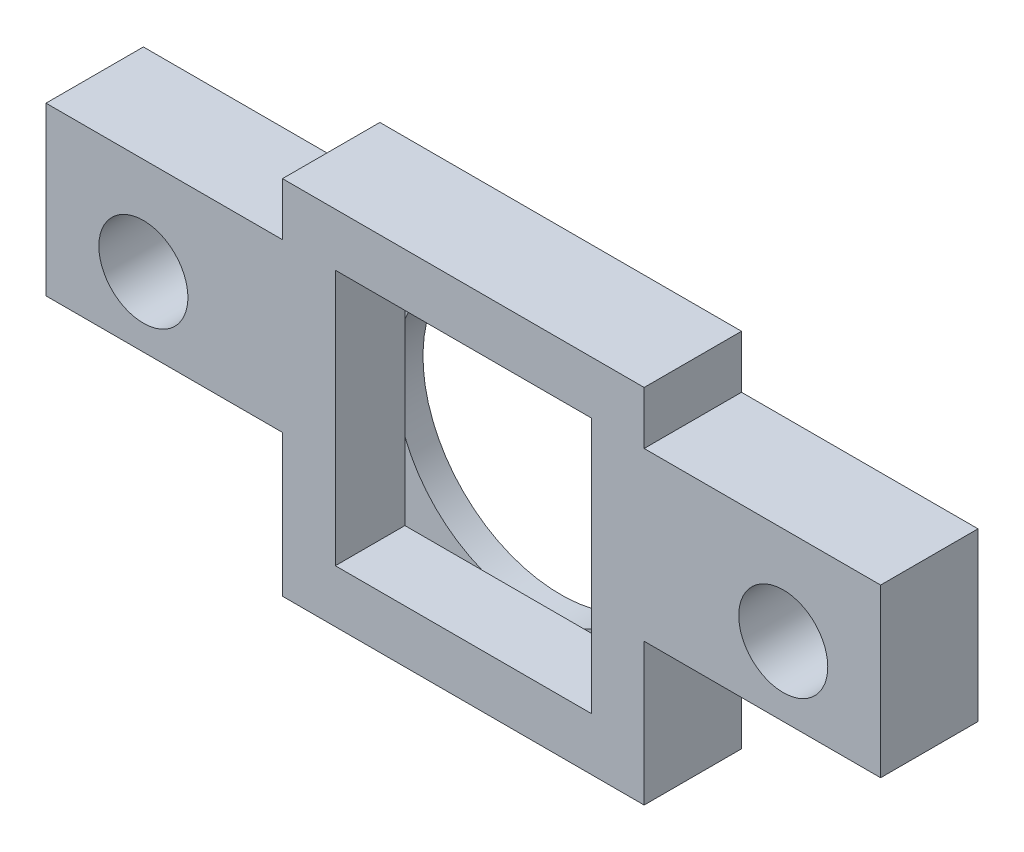
ISO-10303-21;
HEADER;
FILE_DESCRIPTION(('STEP AP214'),'2;1');
FILE_NAME('part.step','',(''),(''),'','','');
FILE_SCHEMA(('AUTOMOTIVE_DESIGN { 1 0 10303 214 1 1 1 1 }'));
ENDSEC;
DATA;
#1=APPLICATION_CONTEXT('core data for automotive mechanical design processes');
#2=APPLICATION_PROTOCOL_DEFINITION('international standard','automotive_design',2000,#1);
#3=PRODUCT_CONTEXT('',#1,'mechanical');
#4=PRODUCT('Part','Part','',(#3));
#5=PRODUCT_RELATED_PRODUCT_CATEGORY('part','',(#4));
#6=PRODUCT_DEFINITION_FORMATION('','',#4);
#7=PRODUCT_DEFINITION_CONTEXT('part definition',#1,'design');
#8=PRODUCT_DEFINITION('design','',#6,#7);
#9=PRODUCT_DEFINITION_SHAPE('','',#8);
#10=(LENGTH_UNIT() NAMED_UNIT(*) SI_UNIT(.MILLI.,.METRE.));
#11=(NAMED_UNIT(*) PLANE_ANGLE_UNIT() SI_UNIT($,.RADIAN.));
#12=(NAMED_UNIT(*) SI_UNIT($,.STERADIAN.) SOLID_ANGLE_UNIT());
#13=UNCERTAINTY_MEASURE_WITH_UNIT(LENGTH_MEASURE(1.E-05),#10,'distance_accuracy_value','');
#14=(GEOMETRIC_REPRESENTATION_CONTEXT(3) GLOBAL_UNCERTAINTY_ASSIGNED_CONTEXT((#13)) GLOBAL_UNIT_ASSIGNED_CONTEXT((#10,
#11,#12)) REPRESENTATION_CONTEXT('',''));
#15=CARTESIAN_POINT('',(0.,0.,0.));
#16=DIRECTION('',(0.,0.,1.));
#17=DIRECTION('',(1.,0.,0.));
#18=AXIS2_PLACEMENT_3D('',#15,#16,#17);
#19=CARTESIAN_POINT('',(-7.06578398919392,7.59595689298066,1.));
#20=DIRECTION('',(1.,0.,0.));
#21=DIRECTION('',(0.,1.,0.));
#22=AXIS2_PLACEMENT_3D('',#19,#20,#21);
#23=PLANE('',#22);
#24=DIRECTION('',(0.,0.,1.));
#25=VECTOR('',#24,1.);
#26=CARTESIAN_POINT('',(-7.06578398919392,-0.304043107019338,0.));
#27=LINE('',#26,#25);
#28=CARTESIAN_POINT('',(-7.06578398919392,-0.304043107019338,0.));
#29=VERTEX_POINT('',#28);
#30=CARTESIAN_POINT('',(-7.06578398919392,-0.304043107019338,3.5));
#31=VERTEX_POINT('',#30);
#32=EDGE_CURVE('E212',#29,#31,#27,.T.);
#33=ORIENTED_EDGE('',*,*,#32,.F.);
#34=DIRECTION('',(0.,-1.,0.));
#35=VECTOR('',#34,1.);
#36=CARTESIAN_POINT('',(-7.06578398919392,7.59595689298066,0.));
#37=LINE('',#36,#35);
#38=CARTESIAN_POINT('',(-7.06578398919391,-5.40404310701934,0.));
#39=VERTEX_POINT('',#38);
#40=EDGE_CURVE('E294',#29,#39,#37,.T.);
#41=ORIENTED_EDGE('',*,*,#40,.T.);
#42=DIRECTION('',(0.,0.,-1.));
#43=VECTOR('',#42,1.);
#44=CARTESIAN_POINT('',(-7.06578398919391,-5.40404310701934,1.));
#45=LINE('',#44,#43);
#46=CARTESIAN_POINT('',(-7.06578398919392,-5.40404310701934,3.5));
#47=VERTEX_POINT('',#46);
#48=EDGE_CURVE('E39',#47,#39,#45,.T.);
#49=ORIENTED_EDGE('',*,*,#48,.F.);
#50=DIRECTION('',(0.,-1.,0.));
#51=VECTOR('',#50,1.);
#52=CARTESIAN_POINT('',(-7.06578398919392,7.59595689298066,3.5));
#53=LINE('',#52,#51);
#54=EDGE_CURVE('E276',#31,#47,#53,.T.);
#55=ORIENTED_EDGE('',*,*,#54,.F.);
#56=EDGE_LOOP('',(#33,#41,#49,#55));
#57=FACE_BOUND('',#56,.T.);
#58=ADVANCED_FACE('F35',(#57),#23,.F.);
#59=CARTESIAN_POINT('',(5.93421601080608,7.59595689298066,1.));
#60=DIRECTION('',(-1.,0.,0.));
#61=DIRECTION('',(0.,-1.,0.));
#62=AXIS2_PLACEMENT_3D('',#59,#60,#61);
#63=PLANE('',#62);
#64=DIRECTION('',(0.,0.,1.));
#65=VECTOR('',#64,1.);
#66=CARTESIAN_POINT('',(5.93421601080608,5.69595689298066,0.));
#67=LINE('',#66,#65);
#68=CARTESIAN_POINT('',(5.93421601080608,5.69595689298066,0.));
#69=VERTEX_POINT('',#68);
#70=CARTESIAN_POINT('',(5.93421601080608,5.69595689298066,3.5));
#71=VERTEX_POINT('',#70);
#72=EDGE_CURVE('E236',#69,#71,#67,.T.);
#73=ORIENTED_EDGE('',*,*,#72,.F.);
#74=DIRECTION('',(0.,1.,0.));
#75=VECTOR('',#74,1.);
#76=CARTESIAN_POINT('',(5.93421601080608,7.59595689298066,0.));
#77=LINE('',#76,#75);
#78=CARTESIAN_POINT('',(5.93421601080608,7.59595689298066,0.));
#79=VERTEX_POINT('',#78);
#80=EDGE_CURVE('E303',#69,#79,#77,.T.);
#81=ORIENTED_EDGE('',*,*,#80,.T.);
#82=DIRECTION('',(0.,0.,-1.));
#83=VECTOR('',#82,1.);
#84=CARTESIAN_POINT('',(5.93421601080608,7.59595689298066,1.));
#85=LINE('',#84,#83);
#86=CARTESIAN_POINT('',(5.93421601080608,7.59595689298066,3.5));
#87=VERTEX_POINT('',#86);
#88=EDGE_CURVE('E312',#87,#79,#85,.T.);
#89=ORIENTED_EDGE('',*,*,#88,.F.);
#90=DIRECTION('',(0.,1.,0.));
#91=VECTOR('',#90,1.);
#92=CARTESIAN_POINT('',(5.93421601080608,7.59595689298066,3.5));
#93=LINE('',#92,#91);
#94=EDGE_CURVE('E283',#71,#87,#93,.T.);
#95=ORIENTED_EDGE('',*,*,#94,.F.);
#96=EDGE_LOOP('',(#73,#81,#89,#95));
#97=FACE_BOUND('',#96,.T.);
#98=ADVANCED_FACE('F400',(#97),#63,.F.);
#99=CARTESIAN_POINT('',(0.,0.,1.));
#100=DIRECTION('',(0.,0.,1.));
#101=DIRECTION('',(1.,0.,0.));
#102=AXIS2_PLACEMENT_3D('',#99,#100,#101);
#103=PLANE('',#102);
#104=CARTESIAN_POINT('',(-0.565783989193916,1.09595689298066,1.));
#105=DIRECTION('',(0.,0.,1.));
#106=DIRECTION('',(1.,0.,0.));
#107=AXIS2_PLACEMENT_3D('',#104,#105,#106);
#108=CIRCLE('',#107,4.95);
#109=CARTESIAN_POINT('',(-5.16578398919392,-0.732293636897562,1.));
#110=VERTEX_POINT('',#109);
#111=CARTESIAN_POINT('',(-2.39403451907214,-3.50404310701934,1.));
#112=VERTEX_POINT('',#111);
#113=EDGE_CURVE('E372',#110,#112,#108,.T.);
#114=ORIENTED_EDGE('',*,*,#113,.F.);
#115=DIRECTION('',(0.,-1.,0.));
#116=VECTOR('',#115,1.);
#117=CARTESIAN_POINT('',(-5.16578398919392,5.69595689298066,1.));
#118=LINE('',#117,#116);
#119=CARTESIAN_POINT('',(-5.16578398919391,-3.50404310701934,1.));
#120=VERTEX_POINT('',#119);
#121=EDGE_CURVE('E11',#110,#120,#118,.T.);
#122=ORIENTED_EDGE('',*,*,#121,.T.);
#123=DIRECTION('',(1.,0.,0.));
#124=VECTOR('',#123,1.);
#125=CARTESIAN_POINT('',(-5.16578398919391,-3.50404310701934,1.));
#126=LINE('',#125,#124);
#127=EDGE_CURVE('E256',#120,#112,#126,.T.);
#128=ORIENTED_EDGE('',*,*,#127,.T.);
#129=EDGE_LOOP('',(#114,#122,#128));
#130=FACE_BOUND('',#129,.T.);
#131=ADVANCED_FACE('F371',(#130),#103,.T.);
#132=CARTESIAN_POINT('',(1.26246654068431,-3.50404310701934,1.));
#133=VERTEX_POINT('',#132);
#134=CARTESIAN_POINT('',(4.03421601080608,-0.732293636897559,1.));
#135=VERTEX_POINT('',#134);
#136=EDGE_CURVE('E375',#133,#135,#108,.T.);
#137=ORIENTED_EDGE('',*,*,#136,.F.);
#138=CARTESIAN_POINT('',(4.03421601080609,-3.50404310701934,1.));
#139=VERTEX_POINT('',#138);
#140=EDGE_CURVE('E44',#133,#139,#126,.T.);
#141=ORIENTED_EDGE('',*,*,#140,.T.);
#142=DIRECTION('',(0.,1.,0.));
#143=VECTOR('',#142,1.);
#144=CARTESIAN_POINT('',(4.03421601080608,5.69595689298066,1.));
#145=LINE('',#144,#143);
#146=EDGE_CURVE('E260',#139,#135,#145,.T.);
#147=ORIENTED_EDGE('',*,*,#146,.T.);
#148=EDGE_LOOP('',(#137,#141,#147));
#149=FACE_BOUND('',#148,.T.);
#150=ADVANCED_FACE('F379',(#149),#103,.T.);
#151=CARTESIAN_POINT('',(4.03421601080608,2.92420742285889,1.));
#152=VERTEX_POINT('',#151);
#153=CARTESIAN_POINT('',(1.26246654068431,5.69595689298066,1.));
#154=VERTEX_POINT('',#153);
#155=EDGE_CURVE('E291',#152,#154,#108,.T.);
#156=ORIENTED_EDGE('',*,*,#155,.F.);
#157=CARTESIAN_POINT('',(4.03421601080608,5.69595689298066,1.));
#158=VERTEX_POINT('',#157);
#159=EDGE_CURVE('E264',#152,#158,#145,.T.);
#160=ORIENTED_EDGE('',*,*,#159,.T.);
#161=DIRECTION('',(-1.,0.,0.));
#162=VECTOR('',#161,1.);
#163=CARTESIAN_POINT('',(-5.16578398919392,5.69595689298066,1.));
#164=LINE('',#163,#162);
#165=EDGE_CURVE('E246',#158,#154,#164,.T.);
#166=ORIENTED_EDGE('',*,*,#165,.T.);
#167=EDGE_LOOP('',(#156,#160,#166));
#168=FACE_BOUND('',#167,.T.);
#169=ADVANCED_FACE('F347',(#168),#103,.T.);
#170=CARTESIAN_POINT('',(-2.39403451907214,5.69595689298066,1.));
#171=VERTEX_POINT('',#170);
#172=CARTESIAN_POINT('',(-5.16578398919392,5.69595689298066,1.));
#173=VERTEX_POINT('',#172);
#174=EDGE_CURVE('E267',#171,#173,#164,.T.);
#175=ORIENTED_EDGE('',*,*,#174,.T.);
#176=CARTESIAN_POINT('',(-5.16578398919392,2.92420742285888,1.));
#177=VERTEX_POINT('',#176);
#178=EDGE_CURVE('E46',#173,#177,#118,.T.);
#179=ORIENTED_EDGE('',*,*,#178,.T.);
#180=EDGE_CURVE('E335',#171,#177,#108,.T.);
#181=ORIENTED_EDGE('',*,*,#180,.F.);
#182=EDGE_LOOP('',(#175,#179,#181));
#183=FACE_BOUND('',#182,.T.);
#184=ADVANCED_FACE('F336',(#183),#103,.T.);
#185=CARTESIAN_POINT('',(0.,0.,0.));
#186=DIRECTION('',(0.,0.,1.));
#187=DIRECTION('',(1.,0.,0.));
#188=AXIS2_PLACEMENT_3D('',#185,#186,#187);
#189=PLANE('',#188);
#190=CARTESIAN_POINT('',(-7.06578398919392,7.59595689298066,0.));
#191=VERTEX_POINT('',#190);
#192=CARTESIAN_POINT('',(-7.06578398919392,5.69595689298066,0.));
#193=VERTEX_POINT('',#192);
#194=EDGE_CURVE('E299',#191,#193,#37,.T.);
#195=ORIENTED_EDGE('',*,*,#194,.F.);
#196=DIRECTION('',(-1.,0.,0.));
#197=VECTOR('',#196,1.);
#198=CARTESIAN_POINT('',(-7.06578398919392,7.59595689298066,0.));
#199=LINE('',#198,#197);
#200=EDGE_CURVE('E307',#79,#191,#199,.T.);
#201=ORIENTED_EDGE('',*,*,#200,.F.);
#202=ORIENTED_EDGE('',*,*,#80,.F.);
#203=DIRECTION('',(-1.,0.,0.));
#204=VECTOR('',#203,1.);
#205=CARTESIAN_POINT('',(5.93421601080608,5.69595689298066,0.));
#206=LINE('',#205,#204);
#207=CARTESIAN_POINT('',(14.4342160108061,5.69595689298066,0.));
#208=VERTEX_POINT('',#207);
#209=EDGE_CURVE('E227',#208,#69,#206,.T.);
#210=ORIENTED_EDGE('',*,*,#209,.F.);
#211=DIRECTION('',(0.,1.,0.));
#212=VECTOR('',#211,1.);
#213=CARTESIAN_POINT('',(14.4342160108061,5.69595689298066,0.));
#214=LINE('',#213,#212);
#215=CARTESIAN_POINT('',(14.4342160108061,-0.304043107019336,0.));
#216=VERTEX_POINT('',#215);
#217=EDGE_CURVE('E223',#216,#208,#214,.T.);
#218=ORIENTED_EDGE('',*,*,#217,.F.);
#219=DIRECTION('',(1.,0.,0.));
#220=VECTOR('',#219,1.);
#221=CARTESIAN_POINT('',(5.93421601080609,-0.304043107019336,0.));
#222=LINE('',#221,#220);
#223=CARTESIAN_POINT('',(5.93421601080609,-0.304043107019336,0.));
#224=VERTEX_POINT('',#223);
#225=EDGE_CURVE('E220',#224,#216,#222,.T.);
#226=ORIENTED_EDGE('',*,*,#225,.F.);
#227=CARTESIAN_POINT('',(5.93421601080608,-5.40404310701934,0.));
#228=VERTEX_POINT('',#227);
#229=EDGE_CURVE('E304',#228,#224,#77,.T.);
#230=ORIENTED_EDGE('',*,*,#229,.F.);
#231=DIRECTION('',(1.,0.,0.));
#232=VECTOR('',#231,1.);
#233=CARTESIAN_POINT('',(-7.06578398919391,-5.40404310701934,0.));
#234=LINE('',#233,#232);
#235=EDGE_CURVE('E301',#39,#228,#234,.T.);
#236=ORIENTED_EDGE('',*,*,#235,.F.);
#237=ORIENTED_EDGE('',*,*,#40,.F.);
#238=DIRECTION('',(1.,0.,0.));
#239=VECTOR('',#238,1.);
#240=CARTESIAN_POINT('',(-7.06578398919392,-0.304043107019338,0.));
#241=LINE('',#240,#239);
#242=CARTESIAN_POINT('',(-15.5657839891939,-0.30404310701934,0.));
#243=VERTEX_POINT('',#242);
#244=EDGE_CURVE('E184',#243,#29,#241,.T.);
#245=ORIENTED_EDGE('',*,*,#244,.F.);
#246=DIRECTION('',(0.,-1.,0.));
#247=VECTOR('',#246,1.);
#248=CARTESIAN_POINT('',(-15.5657839891939,5.69595689298066,0.));
#249=LINE('',#248,#247);
#250=CARTESIAN_POINT('',(-15.5657839891939,5.69595689298066,0.));
#251=VERTEX_POINT('',#250);
#252=EDGE_CURVE('E179',#251,#243,#249,.T.);
#253=ORIENTED_EDGE('',*,*,#252,.F.);
#254=DIRECTION('',(-1.,0.,0.));
#255=VECTOR('',#254,1.);
#256=CARTESIAN_POINT('',(-7.06578398919392,5.69595689298066,0.));
#257=LINE('',#256,#255);
#258=EDGE_CURVE('E192',#193,#251,#257,.T.);
#259=ORIENTED_EDGE('',*,*,#258,.F.);
#260=EDGE_LOOP('',(#195,#201,#202,#210,#218,#226,#230,#236,#237,#245,#253,#259));
#261=FACE_BOUND('',#260,.T.);
#262=CARTESIAN_POINT('',(-0.565783989193916,1.09595689298066,0.));
#263=DIRECTION('',(0.,0.,1.));
#264=DIRECTION('',(1.,0.,0.));
#265=AXIS2_PLACEMENT_3D('',#262,#263,#264);
#266=CIRCLE('',#265,4.95);
#267=CARTESIAN_POINT('',(4.38421601080608,1.09595689298066,0.));
#268=VERTEX_POINT('',#267);
#269=EDGE_CURVE('E290',#268,#268,#266,.T.);
#270=ORIENTED_EDGE('',*,*,#269,.T.);
#271=EDGE_LOOP('',(#270));
#272=FACE_BOUND('',#271,.T.);
#273=CARTESIAN_POINT('',(10.9342160108061,2.19595689298066,0.));
#274=DIRECTION('',(0.,0.,1.));
#275=DIRECTION('',(1.,0.,0.));
#276=AXIS2_PLACEMENT_3D('',#273,#274,#275);
#277=CIRCLE('',#276,1.6);
#278=CARTESIAN_POINT('',(12.5342160108061,2.19595689298066,0.));
#279=VERTEX_POINT('',#278);
#280=EDGE_CURVE('E215',#279,#279,#277,.T.);
#281=ORIENTED_EDGE('',*,*,#280,.T.);
#282=EDGE_LOOP('',(#281));
#283=FACE_BOUND('',#282,.T.);
#284=CARTESIAN_POINT('',(-12.0657839891939,2.19595689298066,0.));
#285=DIRECTION('',(0.,0.,1.));
#286=DIRECTION('',(-1.,0.,0.));
#287=AXIS2_PLACEMENT_3D('',#284,#285,#286);
#288=CIRCLE('',#287,1.6);
#289=CARTESIAN_POINT('',(-13.6657839891939,2.19595689298066,0.));
#290=VERTEX_POINT('',#289);
#291=EDGE_CURVE('E208',#290,#290,#288,.T.);
#292=ORIENTED_EDGE('',*,*,#291,.T.);
#293=EDGE_LOOP('',(#292));
#294=FACE_BOUND('',#293,.T.);
#295=ADVANCED_FACE('F190',(#261,#272,#283,#294),#189,.F.);
#296=ORIENTED_EDGE('',*,*,#194,.T.);
#297=DIRECTION('',(0.,0.,1.));
#298=VECTOR('',#297,1.);
#299=CARTESIAN_POINT('',(-7.06578398919392,5.69595689298066,0.));
#300=LINE('',#299,#298);
#301=CARTESIAN_POINT('',(-7.06578398919392,5.69595689298066,3.5));
#302=VERTEX_POINT('',#301);
#303=EDGE_CURVE('E197',#193,#302,#300,.T.);
#304=ORIENTED_EDGE('',*,*,#303,.T.);
#305=CARTESIAN_POINT('',(-7.06578398919392,7.59595689298066,3.5));
#306=VERTEX_POINT('',#305);
#307=EDGE_CURVE('E277',#306,#302,#53,.T.);
#308=ORIENTED_EDGE('',*,*,#307,.F.);
#309=DIRECTION('',(0.,0.,-1.));
#310=VECTOR('',#309,1.);
#311=CARTESIAN_POINT('',(-7.06578398919392,7.59595689298066,1.));
#312=LINE('',#311,#310);
#313=EDGE_CURVE('E309',#306,#191,#312,.T.);
#314=ORIENTED_EDGE('',*,*,#313,.T.);
#315=EDGE_LOOP('',(#296,#304,#308,#314));
#316=FACE_BOUND('',#315,.T.);
#317=ADVANCED_FACE('F37',(#316),#23,.F.);
#318=CARTESIAN_POINT('',(-7.06578398919391,-5.40404310701934,1.));
#319=DIRECTION('',(0.,1.,0.));
#320=DIRECTION('',(0.,0.,1.));
#321=AXIS2_PLACEMENT_3D('',#318,#319,#320);
#322=PLANE('',#321);
#323=ORIENTED_EDGE('',*,*,#235,.T.);
#324=DIRECTION('',(0.,0.,-1.));
#325=VECTOR('',#324,1.);
#326=CARTESIAN_POINT('',(5.93421601080608,-5.40404310701934,1.));
#327=LINE('',#326,#325);
#328=CARTESIAN_POINT('',(5.93421601080608,-5.40404310701934,3.5));
#329=VERTEX_POINT('',#328);
#330=EDGE_CURVE('E314',#329,#228,#327,.T.);
#331=ORIENTED_EDGE('',*,*,#330,.F.);
#332=DIRECTION('',(1.,0.,0.));
#333=VECTOR('',#332,1.);
#334=CARTESIAN_POINT('',(-7.06578398919392,-5.40404310701934,3.5));
#335=LINE('',#334,#333);
#336=EDGE_CURVE('E280',#47,#329,#335,.T.);
#337=ORIENTED_EDGE('',*,*,#336,.F.);
#338=ORIENTED_EDGE('',*,*,#48,.T.);
#339=EDGE_LOOP('',(#323,#331,#337,#338));
#340=FACE_BOUND('',#339,.T.);
#341=ADVANCED_FACE('F410',(#340),#322,.F.);
#342=ORIENTED_EDGE('',*,*,#229,.T.);
#343=DIRECTION('',(0.,0.,1.));
#344=VECTOR('',#343,1.);
#345=CARTESIAN_POINT('',(5.93421601080609,-0.304043107019336,0.));
#346=LINE('',#345,#344);
#347=CARTESIAN_POINT('',(5.93421601080608,-0.304043107019333,3.5));
#348=VERTEX_POINT('',#347);
#349=EDGE_CURVE('E229',#224,#348,#346,.T.);
#350=ORIENTED_EDGE('',*,*,#349,.T.);
#351=EDGE_CURVE('E284',#329,#348,#93,.T.);
#352=ORIENTED_EDGE('',*,*,#351,.F.);
#353=ORIENTED_EDGE('',*,*,#330,.T.);
#354=EDGE_LOOP('',(#342,#350,#352,#353));
#355=FACE_BOUND('',#354,.T.);
#356=ADVANCED_FACE('F407',(#355),#63,.F.);
#357=CARTESIAN_POINT('',(-7.06578398919392,7.59595689298066,1.));
#358=DIRECTION('',(0.,-1.,0.));
#359=DIRECTION('',(0.,0.,-1.));
#360=AXIS2_PLACEMENT_3D('',#357,#358,#359);
#361=PLANE('',#360);
#362=ORIENTED_EDGE('',*,*,#200,.T.);
#363=ORIENTED_EDGE('',*,*,#313,.F.);
#364=DIRECTION('',(-1.,0.,0.));
#365=VECTOR('',#364,1.);
#366=CARTESIAN_POINT('',(-7.06578398919392,7.59595689298066,3.5));
#367=LINE('',#366,#365);
#368=EDGE_CURVE('E287',#87,#306,#367,.T.);
#369=ORIENTED_EDGE('',*,*,#368,.F.);
#370=ORIENTED_EDGE('',*,*,#88,.T.);
#371=EDGE_LOOP('',(#362,#363,#369,#370));
#372=FACE_BOUND('',#371,.T.);
#373=ADVANCED_FACE('F422',(#372),#361,.F.);
#374=CARTESIAN_POINT('',(-0.565783989193916,1.09595689298066,1.));
#375=DIRECTION('',(0.,0.,-1.));
#376=DIRECTION('',(-1.,0.,0.));
#377=AXIS2_PLACEMENT_3D('',#374,#375,#376);
#378=CYLINDRICAL_SURFACE('',#377,4.95);
#379=ORIENTED_EDGE('',*,*,#155,.T.);
#380=EDGE_CURVE('E295',#154,#171,#108,.T.);
#381=ORIENTED_EDGE('',*,*,#380,.T.);
#382=ORIENTED_EDGE('',*,*,#180,.T.);
#383=EDGE_CURVE('E340',#177,#110,#108,.T.);
#384=ORIENTED_EDGE('',*,*,#383,.T.);
#385=ORIENTED_EDGE('',*,*,#113,.T.);
#386=EDGE_CURVE('E374',#112,#133,#108,.T.);
#387=ORIENTED_EDGE('',*,*,#386,.T.);
#388=ORIENTED_EDGE('',*,*,#136,.T.);
#389=EDGE_CURVE('E296',#135,#152,#108,.T.);
#390=ORIENTED_EDGE('',*,*,#389,.T.);
#391=EDGE_LOOP('',(#379,#381,#382,#384,#385,#387,#388,#390));
#392=FACE_BOUND('',#391,.T.);
#393=ORIENTED_EDGE('',*,*,#269,.F.);
#394=EDGE_LOOP('',(#393));
#395=FACE_BOUND('',#394,.T.);
#396=ADVANCED_FACE('F341',(#392,#395),#378,.F.);
#397=CARTESIAN_POINT('',(0.,0.,1.));
#398=DIRECTION('',(0.,0.,1.));
#399=DIRECTION('',(1.,0.,0.));
#400=AXIS2_PLACEMENT_3D('',#397,#398,#399);
#401=PLANE('',#400);
#402=ORIENTED_EDGE('',*,*,#380,.F.);
#403=EDGE_CURVE('E263',#154,#171,#164,.T.);
#404=ORIENTED_EDGE('',*,*,#403,.T.);
#405=EDGE_LOOP('',(#402,#404));
#406=FACE_BOUND('',#405,.T.);
#407=ADVANCED_FACE('F330',(#406),#401,.F.);
#408=ORIENTED_EDGE('',*,*,#383,.F.);
#409=EDGE_CURVE('E47',#177,#110,#118,.T.);
#410=ORIENTED_EDGE('',*,*,#409,.T.);
#411=EDGE_LOOP('',(#408,#410));
#412=FACE_BOUND('',#411,.T.);
#413=ADVANCED_FACE('F396',(#412),#401,.F.);
#414=ORIENTED_EDGE('',*,*,#386,.F.);
#415=EDGE_CURVE('E255',#112,#133,#126,.T.);
#416=ORIENTED_EDGE('',*,*,#415,.T.);
#417=EDGE_LOOP('',(#414,#416));
#418=FACE_BOUND('',#417,.T.);
#419=ADVANCED_FACE('F386',(#418),#401,.F.);
#420=CARTESIAN_POINT('',(0.,0.,3.5));
#421=DIRECTION('',(0.,0.,1.));
#422=DIRECTION('',(1.,0.,0.));
#423=AXIS2_PLACEMENT_3D('',#420,#421,#422);
#424=PLANE('',#423);
#425=ORIENTED_EDGE('',*,*,#307,.T.);
#426=DIRECTION('',(-1.,0.,0.));
#427=VECTOR('',#426,1.);
#428=CARTESIAN_POINT('',(-7.06578398919392,5.69595689298066,3.5));
#429=LINE('',#428,#427);
#430=CARTESIAN_POINT('',(-15.5657839891939,5.69595689298066,3.5));
#431=VERTEX_POINT('',#430);
#432=EDGE_CURVE('E54',#302,#431,#429,.T.);
#433=ORIENTED_EDGE('',*,*,#432,.T.);
#434=DIRECTION('',(0.,-1.,0.));
#435=VECTOR('',#434,1.);
#436=CARTESIAN_POINT('',(-15.5657839891939,5.69595689298066,3.5));
#437=LINE('',#436,#435);
#438=CARTESIAN_POINT('',(-15.5657839891939,-0.30404310701934,3.5));
#439=VERTEX_POINT('',#438);
#440=EDGE_CURVE('E181',#431,#439,#437,.T.);
#441=ORIENTED_EDGE('',*,*,#440,.T.);
#442=DIRECTION('',(1.,0.,0.));
#443=VECTOR('',#442,1.);
#444=CARTESIAN_POINT('',(-7.06578398919392,-0.304043107019338,3.5));
#445=LINE('',#444,#443);
#446=EDGE_CURVE('E198',#439,#31,#445,.T.);
#447=ORIENTED_EDGE('',*,*,#446,.T.);
#448=ORIENTED_EDGE('',*,*,#54,.T.);
#449=ORIENTED_EDGE('',*,*,#336,.T.);
#450=ORIENTED_EDGE('',*,*,#351,.T.);
#451=DIRECTION('',(1.,0.,0.));
#452=VECTOR('',#451,1.);
#453=CARTESIAN_POINT('',(5.93421601080609,-0.304043107019336,3.5));
#454=LINE('',#453,#452);
#455=CARTESIAN_POINT('',(14.4342160108061,-0.304043107019336,3.5));
#456=VERTEX_POINT('',#455);
#457=EDGE_CURVE('E62',#348,#456,#454,.T.);
#458=ORIENTED_EDGE('',*,*,#457,.T.);
#459=DIRECTION('',(0.,1.,0.));
#460=VECTOR('',#459,1.);
#461=CARTESIAN_POINT('',(14.4342160108061,5.69595689298066,3.5));
#462=LINE('',#461,#460);
#463=CARTESIAN_POINT('',(14.4342160108061,5.69595689298066,3.5));
#464=VERTEX_POINT('',#463);
#465=EDGE_CURVE('E231',#456,#464,#462,.T.);
#466=ORIENTED_EDGE('',*,*,#465,.T.);
#467=DIRECTION('',(-1.,0.,0.));
#468=VECTOR('',#467,1.);
#469=CARTESIAN_POINT('',(5.93421601080608,5.69595689298066,3.5));
#470=LINE('',#469,#468);
#471=EDGE_CURVE('E224',#464,#71,#470,.T.);
#472=ORIENTED_EDGE('',*,*,#471,.T.);
#473=ORIENTED_EDGE('',*,*,#94,.T.);
#474=ORIENTED_EDGE('',*,*,#368,.T.);
#475=EDGE_LOOP('',(#425,#433,#441,#447,#448,#449,#450,#458,#466,#472,#473,#474));
#476=FACE_BOUND('',#475,.T.);
#477=DIRECTION('',(1.,0.,0.));
#478=VECTOR('',#477,1.);
#479=CARTESIAN_POINT('',(-5.16578398919391,-3.50404310701934,3.5));
#480=LINE('',#479,#478);
#481=CARTESIAN_POINT('',(-5.16578398919391,-3.50404310701934,3.5));
#482=VERTEX_POINT('',#481);
#483=CARTESIAN_POINT('',(4.03421601080609,-3.50404310701934,3.5));
#484=VERTEX_POINT('',#483);
#485=EDGE_CURVE('E245',#482,#484,#480,.T.);
#486=ORIENTED_EDGE('',*,*,#485,.F.);
#487=DIRECTION('',(0.,-1.,0.));
#488=VECTOR('',#487,1.);
#489=CARTESIAN_POINT('',(-5.16578398919392,5.69595689298066,3.5));
#490=LINE('',#489,#488);
#491=CARTESIAN_POINT('',(-5.16578398919392,5.69595689298066,3.5));
#492=VERTEX_POINT('',#491);
#493=EDGE_CURVE('E243',#492,#482,#490,.T.);
#494=ORIENTED_EDGE('',*,*,#493,.F.);
#495=DIRECTION('',(-1.,0.,0.));
#496=VECTOR('',#495,1.);
#497=CARTESIAN_POINT('',(-5.16578398919392,5.69595689298066,3.5));
#498=LINE('',#497,#496);
#499=CARTESIAN_POINT('',(4.03421601080608,5.69595689298066,3.5));
#500=VERTEX_POINT('',#499);
#501=EDGE_CURVE('E251',#500,#492,#498,.T.);
#502=ORIENTED_EDGE('',*,*,#501,.F.);
#503=DIRECTION('',(0.,1.,0.));
#504=VECTOR('',#503,1.);
#505=CARTESIAN_POINT('',(4.03421601080608,5.69595689298066,3.5));
#506=LINE('',#505,#504);
#507=EDGE_CURVE('E248',#484,#500,#506,.T.);
#508=ORIENTED_EDGE('',*,*,#507,.F.);
#509=EDGE_LOOP('',(#486,#494,#502,#508));
#510=FACE_BOUND('',#509,.T.);
#511=CARTESIAN_POINT('',(10.9342160108061,2.19595689298066,3.5));
#512=DIRECTION('',(0.,0.,1.));
#513=DIRECTION('',(1.,0.,0.));
#514=AXIS2_PLACEMENT_3D('',#511,#512,#513);
#515=CIRCLE('',#514,1.6);
#516=CARTESIAN_POINT('',(12.5342160108061,2.19595689298066,3.5));
#517=VERTEX_POINT('',#516);
#518=EDGE_CURVE('E211',#517,#517,#515,.T.);
#519=ORIENTED_EDGE('',*,*,#518,.F.);
#520=EDGE_LOOP('',(#519));
#521=FACE_BOUND('',#520,.T.);
#522=CARTESIAN_POINT('',(-12.0657839891939,2.19595689298066,3.5));
#523=DIRECTION('',(0.,0.,1.));
#524=DIRECTION('',(-1.,0.,0.));
#525=AXIS2_PLACEMENT_3D('',#522,#523,#524);
#526=CIRCLE('',#525,1.6);
#527=CARTESIAN_POINT('',(-13.6657839891939,2.19595689298066,3.5));
#528=VERTEX_POINT('',#527);
#529=EDGE_CURVE('E203',#528,#528,#526,.T.);
#530=ORIENTED_EDGE('',*,*,#529,.F.);
#531=EDGE_LOOP('',(#530));
#532=FACE_BOUND('',#531,.T.);
#533=ADVANCED_FACE('F359',(#476,#510,#521,#532),#424,.T.);
#534=ORIENTED_EDGE('',*,*,#389,.F.);
#535=EDGE_CURVE('E259',#135,#152,#145,.T.);
#536=ORIENTED_EDGE('',*,*,#535,.T.);
#537=EDGE_LOOP('',(#534,#536));
#538=FACE_BOUND('',#537,.T.);
#539=ADVANCED_FACE('F383',(#538),#401,.F.);
#540=CARTESIAN_POINT('',(-5.16578398919392,5.69595689298066,3.5));
#541=DIRECTION('',(1.,0.,0.));
#542=DIRECTION('',(0.,1.,0.));
#543=AXIS2_PLACEMENT_3D('',#540,#541,#542);
#544=PLANE('',#543);
#545=ORIENTED_EDGE('',*,*,#178,.F.);
#546=DIRECTION('',(0.,0.,-1.));
#547=VECTOR('',#546,1.);
#548=CARTESIAN_POINT('',(-5.16578398919392,5.69595689298066,3.5));
#549=LINE('',#548,#547);
#550=EDGE_CURVE('E252',#492,#173,#549,.T.);
#551=ORIENTED_EDGE('',*,*,#550,.F.);
#552=ORIENTED_EDGE('',*,*,#493,.T.);
#553=DIRECTION('',(0.,0.,-1.));
#554=VECTOR('',#553,1.);
#555=CARTESIAN_POINT('',(-5.16578398919391,-3.50404310701934,3.5));
#556=LINE('',#555,#554);
#557=EDGE_CURVE('E273',#482,#120,#556,.T.);
#558=ORIENTED_EDGE('',*,*,#557,.T.);
#559=ORIENTED_EDGE('',*,*,#121,.F.);
#560=ORIENTED_EDGE('',*,*,#409,.F.);
#561=EDGE_LOOP('',(#545,#551,#552,#558,#559,#560));
#562=FACE_BOUND('',#561,.T.);
#563=ADVANCED_FACE('F363',(#562),#544,.T.);
#564=CARTESIAN_POINT('',(-5.16578398919391,-3.50404310701934,3.5));
#565=DIRECTION('',(0.,1.,0.));
#566=DIRECTION('',(0.,0.,1.));
#567=AXIS2_PLACEMENT_3D('',#564,#565,#566);
#568=PLANE('',#567);
#569=ORIENTED_EDGE('',*,*,#127,.F.);
#570=ORIENTED_EDGE('',*,*,#557,.F.);
#571=ORIENTED_EDGE('',*,*,#485,.T.);
#572=DIRECTION('',(0.,0.,-1.));
#573=VECTOR('',#572,1.);
#574=CARTESIAN_POINT('',(4.03421601080609,-3.50404310701934,3.5));
#575=LINE('',#574,#573);
#576=EDGE_CURVE('E271',#484,#139,#575,.T.);
#577=ORIENTED_EDGE('',*,*,#576,.T.);
#578=ORIENTED_EDGE('',*,*,#140,.F.);
#579=ORIENTED_EDGE('',*,*,#415,.F.);
#580=EDGE_LOOP('',(#569,#570,#571,#577,#578,#579));
#581=FACE_BOUND('',#580,.T.);
#582=ADVANCED_FACE('F365',(#581),#568,.T.);
#583=CARTESIAN_POINT('',(4.03421601080608,5.69595689298066,3.5));
#584=DIRECTION('',(-1.,0.,0.));
#585=DIRECTION('',(0.,-1.,0.));
#586=AXIS2_PLACEMENT_3D('',#583,#584,#585);
#587=PLANE('',#586);
#588=ORIENTED_EDGE('',*,*,#146,.F.);
#589=ORIENTED_EDGE('',*,*,#576,.F.);
#590=ORIENTED_EDGE('',*,*,#507,.T.);
#591=DIRECTION('',(0.,0.,-1.));
#592=VECTOR('',#591,1.);
#593=CARTESIAN_POINT('',(4.03421601080608,5.69595689298066,3.5));
#594=LINE('',#593,#592);
#595=EDGE_CURVE('E269',#500,#158,#594,.T.);
#596=ORIENTED_EDGE('',*,*,#595,.T.);
#597=ORIENTED_EDGE('',*,*,#159,.F.);
#598=ORIENTED_EDGE('',*,*,#535,.F.);
#599=EDGE_LOOP('',(#588,#589,#590,#596,#597,#598));
#600=FACE_BOUND('',#599,.T.);
#601=ADVANCED_FACE('F355',(#600),#587,.T.);
#602=CARTESIAN_POINT('',(-5.16578398919392,5.69595689298066,3.5));
#603=DIRECTION('',(0.,-1.,0.));
#604=DIRECTION('',(0.,0.,-1.));
#605=AXIS2_PLACEMENT_3D('',#602,#603,#604);
#606=PLANE('',#605);
#607=ORIENTED_EDGE('',*,*,#165,.F.);
#608=ORIENTED_EDGE('',*,*,#595,.F.);
#609=ORIENTED_EDGE('',*,*,#501,.T.);
#610=ORIENTED_EDGE('',*,*,#550,.T.);
#611=ORIENTED_EDGE('',*,*,#174,.F.);
#612=ORIENTED_EDGE('',*,*,#403,.F.);
#613=EDGE_LOOP('',(#607,#608,#609,#610,#611,#612));
#614=FACE_BOUND('',#613,.T.);
#615=ADVANCED_FACE('F348',(#614),#606,.T.);
#616=CARTESIAN_POINT('',(5.93421601080608,5.69595689298066,0.));
#617=DIRECTION('',(0.,1.,0.));
#618=DIRECTION('',(0.,0.,1.));
#619=AXIS2_PLACEMENT_3D('',#616,#617,#618);
#620=PLANE('',#619);
#621=ORIENTED_EDGE('',*,*,#471,.F.);
#622=DIRECTION('',(0.,0.,1.));
#623=VECTOR('',#622,1.);
#624=CARTESIAN_POINT('',(14.4342160108061,5.69595689298066,0.));
#625=LINE('',#624,#623);
#626=EDGE_CURVE('E238',#208,#464,#625,.T.);
#627=ORIENTED_EDGE('',*,*,#626,.F.);
#628=ORIENTED_EDGE('',*,*,#209,.T.);
#629=ORIENTED_EDGE('',*,*,#72,.T.);
#630=EDGE_LOOP('',(#621,#627,#628,#629));
#631=FACE_BOUND('',#630,.T.);
#632=ADVANCED_FACE('F429',(#631),#620,.T.);
#633=CARTESIAN_POINT('',(14.4342160108061,5.69595689298066,0.));
#634=DIRECTION('',(1.,0.,0.));
#635=DIRECTION('',(0.,0.,-1.));
#636=AXIS2_PLACEMENT_3D('',#633,#634,#635);
#637=PLANE('',#636);
#638=ORIENTED_EDGE('',*,*,#465,.F.);
#639=DIRECTION('',(0.,0.,1.));
#640=VECTOR('',#639,1.);
#641=CARTESIAN_POINT('',(14.4342160108061,-0.304043107019336,0.));
#642=LINE('',#641,#640);
#643=EDGE_CURVE('E240',#216,#456,#642,.T.);
#644=ORIENTED_EDGE('',*,*,#643,.F.);
#645=ORIENTED_EDGE('',*,*,#217,.T.);
#646=ORIENTED_EDGE('',*,*,#626,.T.);
#647=EDGE_LOOP('',(#638,#644,#645,#646));
#648=FACE_BOUND('',#647,.T.);
#649=ADVANCED_FACE('F432',(#648),#637,.T.);
#650=CARTESIAN_POINT('',(5.93421601080609,-0.304043107019336,0.));
#651=DIRECTION('',(0.,-1.,0.));
#652=DIRECTION('',(0.,0.,-1.));
#653=AXIS2_PLACEMENT_3D('',#650,#651,#652);
#654=PLANE('',#653);
#655=ORIENTED_EDGE('',*,*,#457,.F.);
#656=ORIENTED_EDGE('',*,*,#349,.F.);
#657=ORIENTED_EDGE('',*,*,#225,.T.);
#658=ORIENTED_EDGE('',*,*,#643,.T.);
#659=EDGE_LOOP('',(#655,#656,#657,#658));
#660=FACE_BOUND('',#659,.T.);
#661=ADVANCED_FACE('F435',(#660),#654,.T.);
#662=CARTESIAN_POINT('',(10.9342160108061,2.19595689298066,0.));
#663=DIRECTION('',(0.,0.,1.));
#664=DIRECTION('',(1.,0.,0.));
#665=AXIS2_PLACEMENT_3D('',#662,#663,#664);
#666=CYLINDRICAL_SURFACE('',#665,1.6);
#667=ORIENTED_EDGE('',*,*,#280,.F.);
#668=EDGE_LOOP('',(#667));
#669=FACE_BOUND('',#668,.T.);
#670=ORIENTED_EDGE('',*,*,#518,.T.);
#671=EDGE_LOOP('',(#670));
#672=FACE_BOUND('',#671,.T.);
#673=ADVANCED_FACE('F449',(#669,#672),#666,.F.);
#674=CARTESIAN_POINT('',(-7.06578398919392,5.69595689298066,0.));
#675=DIRECTION('',(0.,1.,0.));
#676=DIRECTION('',(-1.,0.,0.));
#677=AXIS2_PLACEMENT_3D('',#674,#675,#676);
#678=PLANE('',#677);
#679=ORIENTED_EDGE('',*,*,#432,.F.);
#680=ORIENTED_EDGE('',*,*,#303,.F.);
#681=ORIENTED_EDGE('',*,*,#258,.T.);
#682=DIRECTION('',(0.,0.,1.));
#683=VECTOR('',#682,1.);
#684=CARTESIAN_POINT('',(-15.5657839891939,5.69595689298066,0.));
#685=LINE('',#684,#683);
#686=EDGE_CURVE('E176',#251,#431,#685,.T.);
#687=ORIENTED_EDGE('',*,*,#686,.T.);
#688=EDGE_LOOP('',(#679,#680,#681,#687));
#689=FACE_BOUND('',#688,.T.);
#690=ADVANCED_FACE('F196',(#689),#678,.T.);
#691=CARTESIAN_POINT('',(-7.06578398919392,-0.304043107019338,0.));
#692=DIRECTION('',(0.,-1.,0.));
#693=DIRECTION('',(1.,0.,0.));
#694=AXIS2_PLACEMENT_3D('',#691,#692,#693);
#695=PLANE('',#694);
#696=ORIENTED_EDGE('',*,*,#446,.F.);
#697=DIRECTION('',(0.,0.,1.));
#698=VECTOR('',#697,1.);
#699=CARTESIAN_POINT('',(-15.5657839891939,-0.30404310701934,0.));
#700=LINE('',#699,#698);
#701=EDGE_CURVE('E183',#243,#439,#700,.T.);
#702=ORIENTED_EDGE('',*,*,#701,.F.);
#703=ORIENTED_EDGE('',*,*,#244,.T.);
#704=ORIENTED_EDGE('',*,*,#32,.T.);
#705=EDGE_LOOP('',(#696,#702,#703,#704));
#706=FACE_BOUND('',#705,.T.);
#707=ADVANCED_FACE('F440',(#706),#695,.T.);
#708=CARTESIAN_POINT('',(-15.5657839891939,5.69595689298066,0.));
#709=DIRECTION('',(-1.,0.,0.));
#710=DIRECTION('',(0.,-1.,0.));
#711=AXIS2_PLACEMENT_3D('',#708,#709,#710);
#712=PLANE('',#711);
#713=ORIENTED_EDGE('',*,*,#440,.F.);
#714=ORIENTED_EDGE('',*,*,#686,.F.);
#715=ORIENTED_EDGE('',*,*,#252,.T.);
#716=ORIENTED_EDGE('',*,*,#701,.T.);
#717=EDGE_LOOP('',(#713,#714,#715,#716));
#718=FACE_BOUND('',#717,.T.);
#719=ADVANCED_FACE('F178',(#718),#712,.T.);
#720=CARTESIAN_POINT('',(-12.0657839891939,2.19595689298066,0.));
#721=DIRECTION('',(0.,0.,1.));
#722=DIRECTION('',(1.,0.,0.));
#723=AXIS2_PLACEMENT_3D('',#720,#721,#722);
#724=CYLINDRICAL_SURFACE('',#723,1.6);
#725=ORIENTED_EDGE('',*,*,#291,.F.);
#726=EDGE_LOOP('',(#725));
#727=FACE_BOUND('',#726,.T.);
#728=ORIENTED_EDGE('',*,*,#529,.T.);
#729=EDGE_LOOP('',(#728));
#730=FACE_BOUND('',#729,.T.);
#731=ADVANCED_FACE('F447',(#727,#730),#724,.F.);
#732=CLOSED_SHELL('',(#58,#98,#131,#150,#169,#184,#295,#317,#341,#356,#373,#396,#407,#413,#419,
#533,#539,#563,#582,#601,#615,#632,#649,#661,#673,#690,#707,#719,#731));
#733=MANIFOLD_SOLID_BREP('B2',#732);
#734=ADVANCED_BREP_SHAPE_REPRESENTATION('',(#18,#733),#14);
#735=SHAPE_DEFINITION_REPRESENTATION(#9,#734);
ENDSEC;
END-ISO-10303-21;
